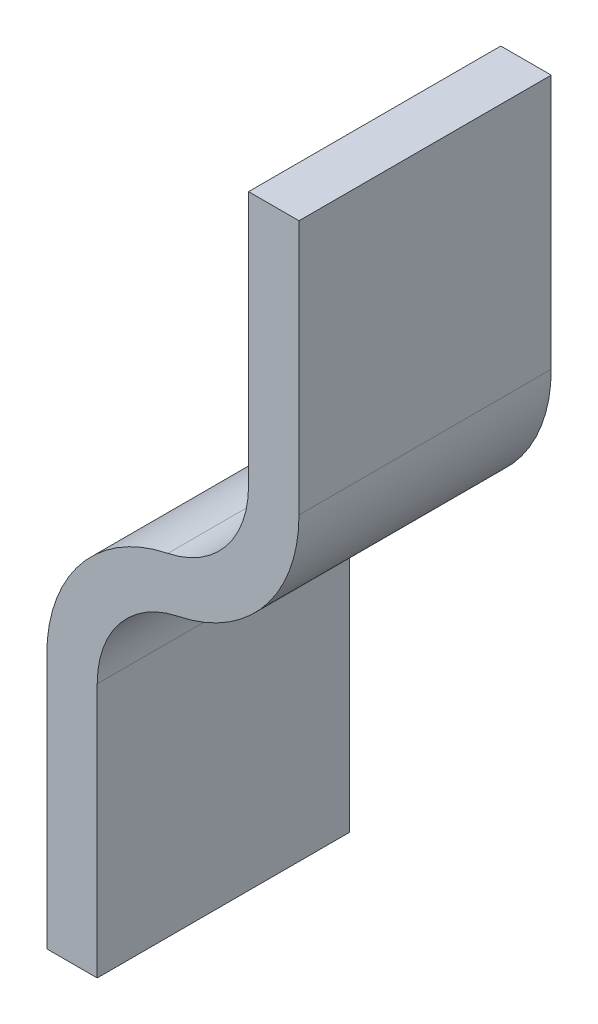
ISO-10303-21;
HEADER;
FILE_DESCRIPTION(('STEP AP214'),'2;1');
FILE_NAME('part.step','',(''),(''),'','','');
FILE_SCHEMA(('AUTOMOTIVE_DESIGN { 1 0 10303 214 1 1 1 1 }'));
ENDSEC;
DATA;
#1=APPLICATION_CONTEXT('core data for automotive mechanical design processes');
#2=APPLICATION_PROTOCOL_DEFINITION('international standard','automotive_design',2000,#1);
#3=PRODUCT_CONTEXT('',#1,'mechanical');
#4=PRODUCT('Part','Part','',(#3));
#5=PRODUCT_RELATED_PRODUCT_CATEGORY('part','',(#4));
#6=PRODUCT_DEFINITION_FORMATION('','',#4);
#7=PRODUCT_DEFINITION_CONTEXT('part definition',#1,'design');
#8=PRODUCT_DEFINITION('design','',#6,#7);
#9=PRODUCT_DEFINITION_SHAPE('','',#8);
#10=(LENGTH_UNIT() NAMED_UNIT(*) SI_UNIT(.MILLI.,.METRE.));
#11=(NAMED_UNIT(*) PLANE_ANGLE_UNIT() SI_UNIT($,.RADIAN.));
#12=(NAMED_UNIT(*) SI_UNIT($,.STERADIAN.) SOLID_ANGLE_UNIT());
#13=UNCERTAINTY_MEASURE_WITH_UNIT(LENGTH_MEASURE(1.E-05),#10,'distance_accuracy_value','');
#14=(GEOMETRIC_REPRESENTATION_CONTEXT(3) GLOBAL_UNCERTAINTY_ASSIGNED_CONTEXT((#13)) GLOBAL_UNIT_ASSIGNED_CONTEXT((#10,
#11,#12)) REPRESENTATION_CONTEXT('',''));
#15=CARTESIAN_POINT('',(0.,0.,0.));
#16=DIRECTION('',(0.,0.,1.));
#17=DIRECTION('',(1.,0.,0.));
#18=AXIS2_PLACEMENT_3D('',#15,#16,#17);
#19=CARTESIAN_POINT('',(0.,0.,-10.));
#20=DIRECTION('',(-1.,0.,0.));
#21=DIRECTION('',(0.,0.,1.));
#22=AXIS2_PLACEMENT_3D('',#19,#20,#21);
#23=PLANE('',#22);
#24=DIRECTION('',(0.,-1.,0.));
#25=VECTOR('',#24,1.);
#26=CARTESIAN_POINT('',(0.,0.,0.));
#27=LINE('',#26,#25);
#28=CARTESIAN_POINT('',(0.,0.,0.));
#29=VERTEX_POINT('',#28);
#30=CARTESIAN_POINT('',(0.,-10.1010205144336,0.));
#31=VERTEX_POINT('',#30);
#32=EDGE_CURVE('E140',#29,#31,#27,.T.);
#33=ORIENTED_EDGE('',*,*,#32,.F.);
#34=DIRECTION('',(0.,0.,1.));
#35=VECTOR('',#34,1.);
#36=CARTESIAN_POINT('',(0.,0.,-10.));
#37=LINE('',#36,#35);
#38=CARTESIAN_POINT('',(0.,0.,-10.));
#39=VERTEX_POINT('',#38);
#40=EDGE_CURVE('E11',#39,#29,#37,.T.);
#41=ORIENTED_EDGE('',*,*,#40,.F.);
#42=DIRECTION('',(0.,-1.,0.));
#43=VECTOR('',#42,1.);
#44=CARTESIAN_POINT('',(0.,0.,-10.));
#45=LINE('',#44,#43);
#46=CARTESIAN_POINT('',(0.,-10.1010205144336,-10.));
#47=VERTEX_POINT('',#46);
#48=EDGE_CURVE('E166',#39,#47,#45,.T.);
#49=ORIENTED_EDGE('',*,*,#48,.T.);
#50=DIRECTION('',(0.,0.,1.));
#51=VECTOR('',#50,1.);
#52=CARTESIAN_POINT('',(0.,-10.1010205144336,-10.));
#53=LINE('',#52,#51);
#54=EDGE_CURVE('E34',#47,#31,#53,.T.);
#55=ORIENTED_EDGE('',*,*,#54,.T.);
#56=EDGE_LOOP('',(#33,#41,#49,#55));
#57=FACE_BOUND('',#56,.T.);
#58=ADVANCED_FACE('F31',(#57),#23,.T.);
#59=CARTESIAN_POINT('',(0.,0.,-10.));
#60=DIRECTION('',(0.,1.,0.));
#61=DIRECTION('',(0.,0.,1.));
#62=AXIS2_PLACEMENT_3D('',#59,#60,#61);
#63=PLANE('',#62);
#64=DIRECTION('',(-1.,0.,0.));
#65=VECTOR('',#64,1.);
#66=CARTESIAN_POINT('',(0.,0.,0.));
#67=LINE('',#66,#65);
#68=CARTESIAN_POINT('',(2.00000000000003,0.,0.));
#69=VERTEX_POINT('',#68);
#70=EDGE_CURVE('E164',#69,#29,#67,.T.);
#71=ORIENTED_EDGE('',*,*,#70,.F.);
#72=DIRECTION('',(0.,0.,1.));
#73=VECTOR('',#72,1.);
#74=CARTESIAN_POINT('',(2.00000000000003,0.,-10.));
#75=LINE('',#74,#73);
#76=CARTESIAN_POINT('',(2.00000000000003,0.,-10.));
#77=VERTEX_POINT('',#76);
#78=EDGE_CURVE('E40',#77,#69,#75,.T.);
#79=ORIENTED_EDGE('',*,*,#78,.F.);
#80=DIRECTION('',(-1.,0.,0.));
#81=VECTOR('',#80,1.);
#82=CARTESIAN_POINT('',(0.,0.,-10.));
#83=LINE('',#82,#81);
#84=EDGE_CURVE('E130',#77,#39,#83,.T.);
#85=ORIENTED_EDGE('',*,*,#84,.T.);
#86=ORIENTED_EDGE('',*,*,#40,.T.);
#87=EDGE_LOOP('',(#71,#79,#85,#86));
#88=FACE_BOUND('',#87,.T.);
#89=ADVANCED_FACE('F182',(#88),#63,.T.);
#90=CARTESIAN_POINT('',(2.00000000000003,0.,-10.));
#91=DIRECTION('',(1.,0.,0.));
#92=DIRECTION('',(0.,1.,0.));
#93=AXIS2_PLACEMENT_3D('',#90,#91,#92);
#94=PLANE('',#93);
#95=DIRECTION('',(0.,1.,0.));
#96=VECTOR('',#95,1.);
#97=CARTESIAN_POINT('',(2.00000000000003,0.,0.));
#98=LINE('',#97,#96);
#99=CARTESIAN_POINT('',(2.,-10.1010205144336,0.));
#100=VERTEX_POINT('',#99);
#101=EDGE_CURVE('E117',#100,#69,#98,.T.);
#102=ORIENTED_EDGE('',*,*,#101,.F.);
#103=DIRECTION('',(0.,0.,1.));
#104=VECTOR('',#103,1.);
#105=CARTESIAN_POINT('',(2.,-10.1010205144336,-10.));
#106=LINE('',#105,#104);
#107=CARTESIAN_POINT('',(2.,-10.1010205144336,-10.));
#108=VERTEX_POINT('',#107);
#109=EDGE_CURVE('E112',#108,#100,#106,.T.);
#110=ORIENTED_EDGE('',*,*,#109,.F.);
#111=DIRECTION('',(0.,1.,0.));
#112=VECTOR('',#111,1.);
#113=CARTESIAN_POINT('',(2.00000000000003,0.,-10.));
#114=LINE('',#113,#112);
#115=EDGE_CURVE('E115',#108,#77,#114,.T.);
#116=ORIENTED_EDGE('',*,*,#115,.T.);
#117=ORIENTED_EDGE('',*,*,#78,.T.);
#118=EDGE_LOOP('',(#102,#110,#116,#117));
#119=FACE_BOUND('',#118,.T.);
#120=ADVANCED_FACE('F114',(#119),#94,.T.);
#121=CARTESIAN_POINT('',(-4.,-10.1010205144336,-10.));
#122=DIRECTION('',(0.,0.,1.));
#123=DIRECTION('',(1.,0.,0.));
#124=AXIS2_PLACEMENT_3D('',#121,#122,#123);
#125=CYLINDRICAL_SURFACE('',#124,6.);
#126=CARTESIAN_POINT('',(-4.,-10.1010205144336,0.));
#127=DIRECTION('',(0.,0.,1.));
#128=DIRECTION('',(-1.,0.,0.));
#129=AXIS2_PLACEMENT_3D('',#126,#127,#128);
#130=CIRCLE('',#129,6.);
#131=CARTESIAN_POINT('',(-2.80000000000002,-15.9797958971133,0.));
#132=VERTEX_POINT('',#131);
#133=EDGE_CURVE('E161',#132,#100,#130,.T.);
#134=ORIENTED_EDGE('',*,*,#133,.F.);
#135=DIRECTION('',(0.,0.,1.));
#136=VECTOR('',#135,1.);
#137=CARTESIAN_POINT('',(-2.80000000000002,-15.9797958971133,-10.));
#138=LINE('',#137,#136);
#139=CARTESIAN_POINT('',(-2.80000000000002,-15.9797958971133,-10.));
#140=VERTEX_POINT('',#139);
#141=EDGE_CURVE('E122',#140,#132,#138,.T.);
#142=ORIENTED_EDGE('',*,*,#141,.F.);
#143=CARTESIAN_POINT('',(-4.,-10.1010205144336,-10.));
#144=DIRECTION('',(0.,0.,1.));
#145=DIRECTION('',(-1.,0.,0.));
#146=AXIS2_PLACEMENT_3D('',#143,#144,#145);
#147=CIRCLE('',#146,6.);
#148=EDGE_CURVE('E128',#140,#108,#147,.T.);
#149=ORIENTED_EDGE('',*,*,#148,.T.);
#150=ORIENTED_EDGE('',*,*,#109,.T.);
#151=EDGE_LOOP('',(#134,#142,#149,#150));
#152=FACE_BOUND('',#151,.T.);
#153=ADVANCED_FACE('F132',(#152),#125,.T.);
#154=CARTESIAN_POINT('',(-2.,-19.8989794855663,-10.));
#155=DIRECTION('',(0.,0.,1.));
#156=DIRECTION('',(1.,0.,0.));
#157=AXIS2_PLACEMENT_3D('',#154,#155,#156);
#158=CYLINDRICAL_SURFACE('',#157,4.00000000000001);
#159=CARTESIAN_POINT('',(-2.,-19.8989794855663,0.));
#160=DIRECTION('',(0.,0.,-1.));
#161=DIRECTION('',(-1.,0.,0.));
#162=AXIS2_PLACEMENT_3D('',#159,#160,#161);
#163=CIRCLE('',#162,4.00000000000001);
#164=CARTESIAN_POINT('',(-6.00000000000001,-19.8989794855663,0.));
#165=VERTEX_POINT('',#164);
#166=EDGE_CURVE('E158',#165,#132,#163,.T.);
#167=ORIENTED_EDGE('',*,*,#166,.F.);
#168=DIRECTION('',(0.,0.,1.));
#169=VECTOR('',#168,1.);
#170=CARTESIAN_POINT('',(-6.00000000000001,-19.8989794855663,-10.));
#171=LINE('',#170,#169);
#172=CARTESIAN_POINT('',(-6.00000000000001,-19.8989794855663,-10.));
#173=VERTEX_POINT('',#172);
#174=EDGE_CURVE('E170',#173,#165,#171,.T.);
#175=ORIENTED_EDGE('',*,*,#174,.F.);
#176=CARTESIAN_POINT('',(-2.,-19.8989794855663,-10.));
#177=DIRECTION('',(0.,0.,-1.));
#178=DIRECTION('',(-1.,0.,0.));
#179=AXIS2_PLACEMENT_3D('',#176,#177,#178);
#180=CIRCLE('',#179,4.00000000000001);
#181=EDGE_CURVE('E133',#173,#140,#180,.T.);
#182=ORIENTED_EDGE('',*,*,#181,.T.);
#183=ORIENTED_EDGE('',*,*,#141,.T.);
#184=EDGE_LOOP('',(#167,#175,#182,#183));
#185=FACE_BOUND('',#184,.T.);
#186=ADVANCED_FACE('F195',(#185),#158,.F.);
#187=CARTESIAN_POINT('',(-6.00000000000001,-30.,-10.));
#188=DIRECTION('',(1.,0.,0.));
#189=DIRECTION('',(0.,0.,-1.));
#190=AXIS2_PLACEMENT_3D('',#187,#188,#189);
#191=PLANE('',#190);
#192=DIRECTION('',(0.,1.,0.));
#193=VECTOR('',#192,1.);
#194=CARTESIAN_POINT('',(-6.00000000000001,-30.,0.));
#195=LINE('',#194,#193);
#196=CARTESIAN_POINT('',(-6.00000000000001,-30.,0.));
#197=VERTEX_POINT('',#196);
#198=EDGE_CURVE('E155',#197,#165,#195,.T.);
#199=ORIENTED_EDGE('',*,*,#198,.F.);
#200=DIRECTION('',(0.,0.,1.));
#201=VECTOR('',#200,1.);
#202=CARTESIAN_POINT('',(-6.00000000000001,-30.,-10.));
#203=LINE('',#202,#201);
#204=CARTESIAN_POINT('',(-6.00000000000001,-30.,-10.));
#205=VERTEX_POINT('',#204);
#206=EDGE_CURVE('E172',#205,#197,#203,.T.);
#207=ORIENTED_EDGE('',*,*,#206,.F.);
#208=DIRECTION('',(0.,1.,0.));
#209=VECTOR('',#208,1.);
#210=CARTESIAN_POINT('',(-6.00000000000001,-30.,-10.));
#211=LINE('',#210,#209);
#212=EDGE_CURVE('E135',#205,#173,#211,.T.);
#213=ORIENTED_EDGE('',*,*,#212,.T.);
#214=ORIENTED_EDGE('',*,*,#174,.T.);
#215=EDGE_LOOP('',(#199,#207,#213,#214));
#216=FACE_BOUND('',#215,.T.);
#217=ADVANCED_FACE('F198',(#216),#191,.T.);
#218=CARTESIAN_POINT('',(-8.00000000000001,-30.,-10.));
#219=DIRECTION('',(0.,-1.,0.));
#220=DIRECTION('',(0.,0.,-1.));
#221=AXIS2_PLACEMENT_3D('',#218,#219,#220);
#222=PLANE('',#221);
#223=DIRECTION('',(1.,0.,0.));
#224=VECTOR('',#223,1.);
#225=CARTESIAN_POINT('',(-8.00000000000001,-30.,0.));
#226=LINE('',#225,#224);
#227=CARTESIAN_POINT('',(-8.00000000000001,-30.,0.));
#228=VERTEX_POINT('',#227);
#229=EDGE_CURVE('E152',#228,#197,#226,.T.);
#230=ORIENTED_EDGE('',*,*,#229,.F.);
#231=DIRECTION('',(0.,0.,1.));
#232=VECTOR('',#231,1.);
#233=CARTESIAN_POINT('',(-8.00000000000001,-30.,-10.));
#234=LINE('',#233,#232);
#235=CARTESIAN_POINT('',(-8.00000000000001,-30.,-10.));
#236=VERTEX_POINT('',#235);
#237=EDGE_CURVE('E174',#236,#228,#234,.T.);
#238=ORIENTED_EDGE('',*,*,#237,.F.);
#239=DIRECTION('',(1.,0.,0.));
#240=VECTOR('',#239,1.);
#241=CARTESIAN_POINT('',(-8.00000000000001,-30.,-10.));
#242=LINE('',#241,#240);
#243=EDGE_CURVE('E297',#236,#205,#242,.T.);
#244=ORIENTED_EDGE('',*,*,#243,.T.);
#245=ORIENTED_EDGE('',*,*,#206,.T.);
#246=EDGE_LOOP('',(#230,#238,#244,#245));
#247=FACE_BOUND('',#246,.T.);
#248=ADVANCED_FACE('F202',(#247),#222,.T.);
#249=CARTESIAN_POINT('',(-8.00000000000001,-19.8989794855663,-10.));
#250=DIRECTION('',(-1.,0.,0.));
#251=DIRECTION('',(0.,0.,1.));
#252=AXIS2_PLACEMENT_3D('',#249,#250,#251);
#253=PLANE('',#252);
#254=DIRECTION('',(0.,-1.,0.));
#255=VECTOR('',#254,1.);
#256=CARTESIAN_POINT('',(-8.00000000000001,-19.8989794855663,0.));
#257=LINE('',#256,#255);
#258=CARTESIAN_POINT('',(-8.00000000000001,-19.8989794855663,0.));
#259=VERTEX_POINT('',#258);
#260=EDGE_CURVE('E149',#259,#228,#257,.T.);
#261=ORIENTED_EDGE('',*,*,#260,.F.);
#262=DIRECTION('',(0.,0.,1.));
#263=VECTOR('',#262,1.);
#264=CARTESIAN_POINT('',(-8.00000000000001,-19.8989794855663,-10.));
#265=LINE('',#264,#263);
#266=CARTESIAN_POINT('',(-8.00000000000001,-19.8989794855663,-10.));
#267=VERTEX_POINT('',#266);
#268=EDGE_CURVE('E176',#267,#259,#265,.T.);
#269=ORIENTED_EDGE('',*,*,#268,.F.);
#270=DIRECTION('',(0.,-1.,0.));
#271=VECTOR('',#270,1.);
#272=CARTESIAN_POINT('',(-8.00000000000001,-19.8989794855663,-10.));
#273=LINE('',#272,#271);
#274=EDGE_CURVE('E293',#267,#236,#273,.T.);
#275=ORIENTED_EDGE('',*,*,#274,.T.);
#276=ORIENTED_EDGE('',*,*,#237,.T.);
#277=EDGE_LOOP('',(#261,#269,#275,#276));
#278=FACE_BOUND('',#277,.T.);
#279=ADVANCED_FACE('F206',(#278),#253,.T.);
#280=CARTESIAN_POINT('',(-2.,-19.8989794855663,-10.));
#281=DIRECTION('',(0.,0.,1.));
#282=DIRECTION('',(1.,0.,0.));
#283=AXIS2_PLACEMENT_3D('',#280,#281,#282);
#284=CYLINDRICAL_SURFACE('',#283,6.00000000000001);
#285=CARTESIAN_POINT('',(-2.,-19.8989794855663,0.));
#286=DIRECTION('',(0.,0.,1.));
#287=DIRECTION('',(-1.,0.,0.));
#288=AXIS2_PLACEMENT_3D('',#285,#286,#287);
#289=CIRCLE('',#288,6.00000000000001);
#290=CARTESIAN_POINT('',(-3.19999999999998,-14.0202041028867,0.));
#291=VERTEX_POINT('',#290);
#292=EDGE_CURVE('E146',#291,#259,#289,.T.);
#293=ORIENTED_EDGE('',*,*,#292,.F.);
#294=DIRECTION('',(0.,0.,1.));
#295=VECTOR('',#294,1.);
#296=CARTESIAN_POINT('',(-3.19999999999998,-14.0202041028867,-10.));
#297=LINE('',#296,#295);
#298=CARTESIAN_POINT('',(-3.19999999999998,-14.0202041028867,-10.));
#299=VERTEX_POINT('',#298);
#300=EDGE_CURVE('E177',#299,#291,#297,.T.);
#301=ORIENTED_EDGE('',*,*,#300,.F.);
#302=CARTESIAN_POINT('',(-2.,-19.8989794855663,-10.));
#303=DIRECTION('',(0.,0.,1.));
#304=DIRECTION('',(-1.,0.,0.));
#305=AXIS2_PLACEMENT_3D('',#302,#303,#304);
#306=CIRCLE('',#305,6.00000000000001);
#307=EDGE_CURVE('E304',#299,#267,#306,.T.);
#308=ORIENTED_EDGE('',*,*,#307,.T.);
#309=ORIENTED_EDGE('',*,*,#268,.T.);
#310=EDGE_LOOP('',(#293,#301,#308,#309));
#311=FACE_BOUND('',#310,.T.);
#312=ADVANCED_FACE('F210',(#311),#284,.T.);
#313=CARTESIAN_POINT('',(-4.,-10.1010205144336,-10.));
#314=DIRECTION('',(0.,0.,1.));
#315=DIRECTION('',(1.,0.,0.));
#316=AXIS2_PLACEMENT_3D('',#313,#314,#315);
#317=CYLINDRICAL_SURFACE('',#316,4.00000000000001);
#318=CARTESIAN_POINT('',(-4.,-10.1010205144336,0.));
#319=DIRECTION('',(0.,0.,-1.));
#320=DIRECTION('',(-1.,0.,0.));
#321=AXIS2_PLACEMENT_3D('',#318,#319,#320);
#322=CIRCLE('',#321,4.00000000000001);
#323=EDGE_CURVE('E143',#31,#291,#322,.T.);
#324=ORIENTED_EDGE('',*,*,#323,.F.);
#325=ORIENTED_EDGE('',*,*,#54,.F.);
#326=CARTESIAN_POINT('',(-4.,-10.1010205144336,-10.));
#327=DIRECTION('',(0.,0.,-1.));
#328=DIRECTION('',(-1.,0.,0.));
#329=AXIS2_PLACEMENT_3D('',#326,#327,#328);
#330=CIRCLE('',#329,4.00000000000001);
#331=EDGE_CURVE('E306',#47,#299,#330,.T.);
#332=ORIENTED_EDGE('',*,*,#331,.T.);
#333=ORIENTED_EDGE('',*,*,#300,.T.);
#334=EDGE_LOOP('',(#324,#325,#332,#333));
#335=FACE_BOUND('',#334,.T.);
#336=ADVANCED_FACE('F179',(#335),#317,.F.);
#337=CARTESIAN_POINT('',(-4.,-10.1010205144336,-10.));
#338=DIRECTION('',(0.,0.,-1.));
#339=DIRECTION('',(-1.,0.,0.));
#340=AXIS2_PLACEMENT_3D('',#337,#338,#339);
#341=PLANE('',#340);
#342=ORIENTED_EDGE('',*,*,#48,.F.);
#343=ORIENTED_EDGE('',*,*,#84,.F.);
#344=ORIENTED_EDGE('',*,*,#115,.F.);
#345=ORIENTED_EDGE('',*,*,#148,.F.);
#346=ORIENTED_EDGE('',*,*,#181,.F.);
#347=ORIENTED_EDGE('',*,*,#212,.F.);
#348=ORIENTED_EDGE('',*,*,#243,.F.);
#349=ORIENTED_EDGE('',*,*,#274,.F.);
#350=ORIENTED_EDGE('',*,*,#307,.F.);
#351=ORIENTED_EDGE('',*,*,#331,.F.);
#352=EDGE_LOOP('',(#342,#343,#344,#345,#346,#347,#348,#349,#350,#351));
#353=FACE_BOUND('',#352,.T.);
#354=ADVANCED_FACE('F126',(#353),#341,.T.);
#355=CARTESIAN_POINT('',(-4.,-10.1010205144336,0.));
#356=DIRECTION('',(0.,0.,-1.));
#357=DIRECTION('',(-1.,0.,0.));
#358=AXIS2_PLACEMENT_3D('',#355,#356,#357);
#359=PLANE('',#358);
#360=ORIENTED_EDGE('',*,*,#32,.T.);
#361=ORIENTED_EDGE('',*,*,#323,.T.);
#362=ORIENTED_EDGE('',*,*,#292,.T.);
#363=ORIENTED_EDGE('',*,*,#260,.T.);
#364=ORIENTED_EDGE('',*,*,#229,.T.);
#365=ORIENTED_EDGE('',*,*,#198,.T.);
#366=ORIENTED_EDGE('',*,*,#166,.T.);
#367=ORIENTED_EDGE('',*,*,#133,.T.);
#368=ORIENTED_EDGE('',*,*,#101,.T.);
#369=ORIENTED_EDGE('',*,*,#70,.T.);
#370=EDGE_LOOP('',(#360,#361,#362,#363,#364,#365,#366,#367,#368,#369));
#371=FACE_BOUND('',#370,.T.);
#372=ADVANCED_FACE('F181',(#371),#359,.F.);
#373=CLOSED_SHELL('',(#58,#89,#120,#153,#186,#217,#248,#279,#312,#336,#354,#372));
#374=MANIFOLD_SOLID_BREP('B2',#373);
#375=ADVANCED_BREP_SHAPE_REPRESENTATION('',(#18,#374),#14);
#376=SHAPE_DEFINITION_REPRESENTATION(#9,#375);
ENDSEC;
END-ISO-10303-21;
